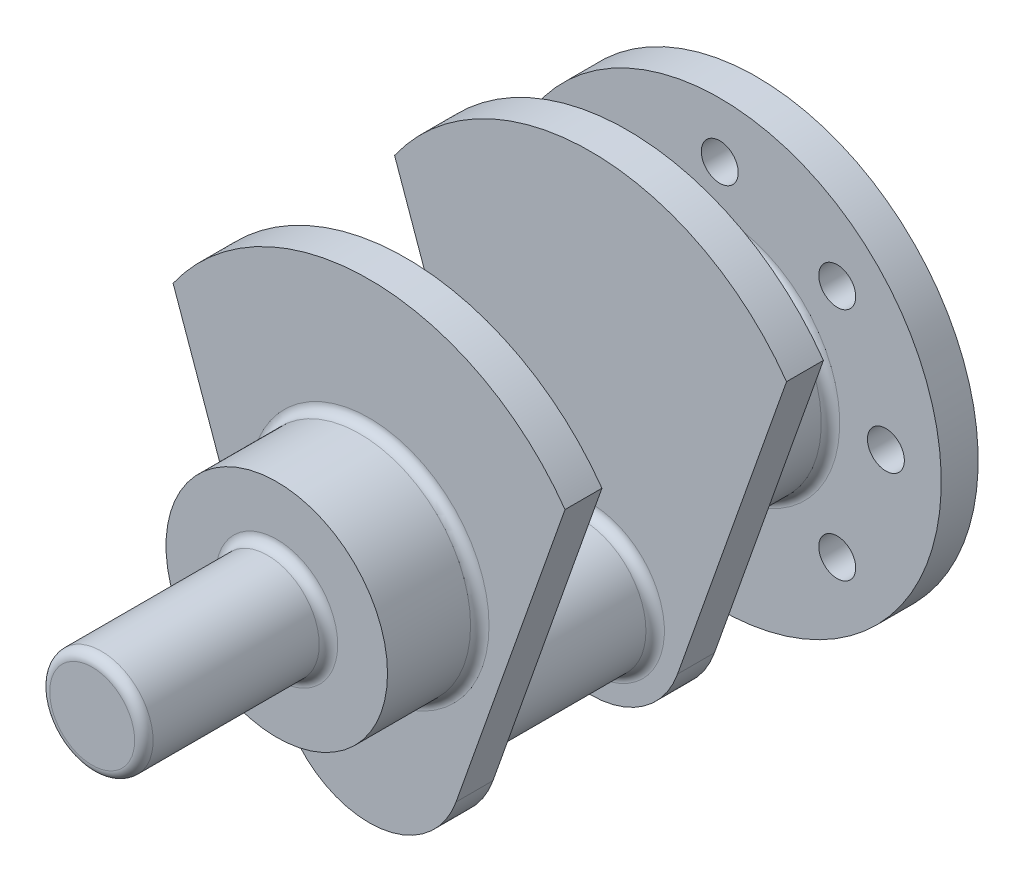
ISO-10303-21;
HEADER;
FILE_DESCRIPTION(('STEP AP214'),'2;1');
FILE_NAME('part.step','',(''),(''),'','','');
FILE_SCHEMA(('AUTOMOTIVE_DESIGN { 1 0 10303 214 1 1 1 1 }'));
ENDSEC;
DATA;
#1=APPLICATION_CONTEXT('core data for automotive mechanical design processes');
#2=APPLICATION_PROTOCOL_DEFINITION('international standard','automotive_design',2000,#1);
#3=PRODUCT_CONTEXT('',#1,'mechanical');
#4=PRODUCT('Part','Part','',(#3));
#5=PRODUCT_RELATED_PRODUCT_CATEGORY('part','',(#4));
#6=PRODUCT_DEFINITION_FORMATION('','',#4);
#7=PRODUCT_DEFINITION_CONTEXT('part definition',#1,'design');
#8=PRODUCT_DEFINITION('design','',#6,#7);
#9=PRODUCT_DEFINITION_SHAPE('','',#8);
#10=(LENGTH_UNIT() NAMED_UNIT(*) SI_UNIT(.MILLI.,.METRE.));
#11=(NAMED_UNIT(*) PLANE_ANGLE_UNIT() SI_UNIT($,.RADIAN.));
#12=(NAMED_UNIT(*) SI_UNIT($,.STERADIAN.) SOLID_ANGLE_UNIT());
#13=UNCERTAINTY_MEASURE_WITH_UNIT(LENGTH_MEASURE(1.E-05),#10,'distance_accuracy_value','');
#14=(GEOMETRIC_REPRESENTATION_CONTEXT(3) GLOBAL_UNCERTAINTY_ASSIGNED_CONTEXT((#13)) GLOBAL_UNIT_ASSIGNED_CONTEXT((#10,
#11,#12)) REPRESENTATION_CONTEXT('',''));
#15=CARTESIAN_POINT('',(0.,0.,0.));
#16=DIRECTION('',(0.,0.,1.));
#17=DIRECTION('',(1.,0.,0.));
#18=AXIS2_PLACEMENT_3D('',#15,#16,#17);
#19=CARTESIAN_POINT('',(0.,0.,20.));
#20=DIRECTION('',(0.,0.,-1.));
#21=DIRECTION('',(-1.,0.,0.));
#22=AXIS2_PLACEMENT_3D('',#19,#20,#21);
#23=CYLINDRICAL_SURFACE('',#22,130.);
#24=CARTESIAN_POINT('',(0.,0.,0.));
#25=DIRECTION('',(0.,0.,1.));
#26=DIRECTION('',(1.,0.,0.));
#27=AXIS2_PLACEMENT_3D('',#24,#25,#26);
#28=CIRCLE('',#27,130.);
#29=CARTESIAN_POINT('',(-106.16809456975,75.0222346736533,0.));
#30=VERTEX_POINT('',#29);
#31=CARTESIAN_POINT('',(106.16809456975,75.0222346736533,0.));
#32=VERTEX_POINT('',#31);
#33=EDGE_CURVE('E139',#30,#32,#28,.F.);
#34=ORIENTED_EDGE('',*,*,#33,.F.);
#35=DIRECTION('',(0.,0.,-1.));
#36=VECTOR('',#35,1.);
#37=CARTESIAN_POINT('',(-106.16809456975,75.0222346736533,20.));
#38=LINE('',#37,#36);
#39=CARTESIAN_POINT('',(-106.16809456975,75.0222346736533,20.));
#40=VERTEX_POINT('',#39);
#41=EDGE_CURVE('E82',#40,#30,#38,.T.);
#42=ORIENTED_EDGE('',*,*,#41,.F.);
#43=CARTESIAN_POINT('',(0.,0.,20.));
#44=DIRECTION('',(0.,0.,1.));
#45=DIRECTION('',(1.,0.,0.));
#46=AXIS2_PLACEMENT_3D('',#43,#44,#45);
#47=CIRCLE('',#46,130.);
#48=CARTESIAN_POINT('',(106.16809456975,75.0222346736533,20.));
#49=VERTEX_POINT('',#48);
#50=EDGE_CURVE('E145',#40,#49,#47,.F.);
#51=ORIENTED_EDGE('',*,*,#50,.T.);
#52=DIRECTION('',(0.,0.,-1.));
#53=VECTOR('',#52,1.);
#54=CARTESIAN_POINT('',(106.16809456975,75.0222346736533,20.));
#55=LINE('',#54,#53);
#56=EDGE_CURVE('E58',#49,#32,#55,.T.);
#57=ORIENTED_EDGE('',*,*,#56,.T.);
#58=EDGE_LOOP('',(#34,#42,#51,#57));
#59=FACE_BOUND('',#58,.T.);
#60=ADVANCED_FACE('F41',(#59),#23,.T.);
#61=CARTESIAN_POINT('',(-70.7315892189778,-25.0473694070523,20.));
#62=DIRECTION('',(0.942641491092178,0.333806859233772,0.));
#63=DIRECTION('',(-0.333806859233772,0.942641491092178,0.));
#64=AXIS2_PLACEMENT_3D('',#61,#62,#63);
#65=PLANE('',#64);
#66=DIRECTION('',(0.333806859233772,-0.942641491092178,0.));
#67=VECTOR('',#66,1.);
#68=CARTESIAN_POINT('',(-70.7315892189778,-25.0473694070523,0.));
#69=LINE('',#68,#67);
#70=CARTESIAN_POINT('',(-47.1320745546089,-91.6903429616886,0.));
#71=VERTEX_POINT('',#70);
#72=EDGE_CURVE('E155',#30,#71,#69,.T.);
#73=ORIENTED_EDGE('',*,*,#72,.T.);
#74=DIRECTION('',(0.,0.,-1.));
#75=VECTOR('',#74,1.);
#76=CARTESIAN_POINT('',(-47.1320745546089,-91.6903429616886,20.));
#77=LINE('',#76,#75);
#78=CARTESIAN_POINT('',(-47.1320745546089,-91.6903429616886,20.));
#79=VERTEX_POINT('',#78);
#80=EDGE_CURVE('E163',#79,#71,#77,.T.);
#81=ORIENTED_EDGE('',*,*,#80,.F.);
#82=DIRECTION('',(0.333806859233772,-0.942641491092178,0.));
#83=VECTOR('',#82,1.);
#84=CARTESIAN_POINT('',(-70.7315892189778,-25.0473694070523,20.));
#85=LINE('',#84,#83);
#86=EDGE_CURVE('E147',#40,#79,#85,.T.);
#87=ORIENTED_EDGE('',*,*,#86,.F.);
#88=ORIENTED_EDGE('',*,*,#41,.T.);
#89=EDGE_LOOP('',(#73,#81,#87,#88));
#90=FACE_BOUND('',#89,.T.);
#91=ADVANCED_FACE('F238',(#90),#65,.F.);
#92=CARTESIAN_POINT('',(0.,-75.,20.));
#93=DIRECTION('',(0.,0.,-1.));
#94=DIRECTION('',(-1.,0.,0.));
#95=AXIS2_PLACEMENT_3D('',#92,#93,#94);
#96=CYLINDRICAL_SURFACE('',#95,50.);
#97=CARTESIAN_POINT('',(0.,-75.,0.));
#98=DIRECTION('',(0.,0.,1.));
#99=DIRECTION('',(1.,0.,0.));
#100=AXIS2_PLACEMENT_3D('',#97,#98,#99);
#101=CIRCLE('',#100,50.);
#102=CARTESIAN_POINT('',(47.1320745546089,-91.6903429616886,0.));
#103=VERTEX_POINT('',#102);
#104=EDGE_CURVE('E157',#71,#103,#101,.T.);
#105=ORIENTED_EDGE('',*,*,#104,.T.);
#106=DIRECTION('',(0.,0.,-1.));
#107=VECTOR('',#106,1.);
#108=CARTESIAN_POINT('',(47.1320745546089,-91.6903429616886,20.));
#109=LINE('',#108,#107);
#110=CARTESIAN_POINT('',(47.1320745546089,-91.6903429616886,20.));
#111=VERTEX_POINT('',#110);
#112=EDGE_CURVE('E74',#111,#103,#109,.T.);
#113=ORIENTED_EDGE('',*,*,#112,.F.);
#114=CARTESIAN_POINT('',(0.,-75.,20.));
#115=DIRECTION('',(0.,0.,1.));
#116=DIRECTION('',(1.,0.,0.));
#117=AXIS2_PLACEMENT_3D('',#114,#115,#116);
#118=CIRCLE('',#117,50.);
#119=EDGE_CURVE('E150',#79,#111,#118,.T.);
#120=ORIENTED_EDGE('',*,*,#119,.F.);
#121=ORIENTED_EDGE('',*,*,#80,.T.);
#122=EDGE_LOOP('',(#105,#113,#120,#121));
#123=FACE_BOUND('',#122,.T.);
#124=ADVANCED_FACE('F243',(#123),#96,.T.);
#125=CARTESIAN_POINT('',(70.7315892189779,-25.0473694070522,20.));
#126=DIRECTION('',(0.942641491092178,-0.333806859233772,0.));
#127=DIRECTION('',(0.333806859233772,0.942641491092178,0.));
#128=AXIS2_PLACEMENT_3D('',#125,#126,#127);
#129=PLANE('',#128);
#130=DIRECTION('',(-0.333806859233772,-0.942641491092178,0.));
#131=VECTOR('',#130,1.);
#132=CARTESIAN_POINT('',(70.7315892189779,-25.0473694070522,0.));
#133=LINE('',#132,#131);
#134=EDGE_CURVE('E148',#32,#103,#133,.T.);
#135=ORIENTED_EDGE('',*,*,#134,.F.);
#136=ORIENTED_EDGE('',*,*,#56,.F.);
#137=DIRECTION('',(-0.333806859233772,-0.942641491092178,0.));
#138=VECTOR('',#137,1.);
#139=CARTESIAN_POINT('',(70.7315892189779,-25.0473694070522,20.));
#140=LINE('',#139,#138);
#141=EDGE_CURVE('E152',#49,#111,#140,.T.);
#142=ORIENTED_EDGE('',*,*,#141,.T.);
#143=ORIENTED_EDGE('',*,*,#112,.T.);
#144=EDGE_LOOP('',(#135,#136,#142,#143));
#145=FACE_BOUND('',#144,.T.);
#146=ADVANCED_FACE('F295',(#145),#129,.T.);
#147=CARTESIAN_POINT('',(0.,0.,20.));
#148=DIRECTION('',(0.,0.,1.));
#149=DIRECTION('',(1.,0.,0.));
#150=AXIS2_PLACEMENT_3D('',#147,#148,#149);
#151=PLANE('',#150);
#152=CARTESIAN_POINT('',(0.,0.,20.));
#153=DIRECTION('',(0.,0.,1.));
#154=DIRECTION('',(1.,0.,0.));
#155=AXIS2_PLACEMENT_3D('',#152,#153,#154);
#156=CIRCLE('',#155,65.);
#157=CARTESIAN_POINT('',(65.,0.,20.));
#158=VERTEX_POINT('',#157);
#159=EDGE_CURVE('E194',#158,#158,#156,.F.);
#160=ORIENTED_EDGE('',*,*,#159,.T.);
#161=EDGE_LOOP('',(#160));
#162=FACE_BOUND('',#161,.T.);
#163=ORIENTED_EDGE('',*,*,#50,.F.);
#164=ORIENTED_EDGE('',*,*,#86,.T.);
#165=ORIENTED_EDGE('',*,*,#119,.T.);
#166=ORIENTED_EDGE('',*,*,#141,.F.);
#167=EDGE_LOOP('',(#163,#164,#165,#166));
#168=FACE_BOUND('',#167,.T.);
#169=ADVANCED_FACE('F292',(#162,#168),#151,.T.);
#170=CARTESIAN_POINT('',(0.,0.,0.));
#171=DIRECTION('',(0.,0.,1.));
#172=DIRECTION('',(1.,0.,0.));
#173=AXIS2_PLACEMENT_3D('',#170,#171,#172);
#174=PLANE('',#173);
#175=CARTESIAN_POINT('',(0.,-75.,0.));
#176=DIRECTION('',(0.,0.,1.));
#177=DIRECTION('',(1.,0.,0.));
#178=AXIS2_PLACEMENT_3D('',#175,#176,#177);
#179=CIRCLE('',#178,40.);
#180=CARTESIAN_POINT('',(40.0000000000001,-75.,0.));
#181=VERTEX_POINT('',#180);
#182=EDGE_CURVE('E188',#181,#181,#179,.T.);
#183=ORIENTED_EDGE('',*,*,#182,.T.);
#184=EDGE_LOOP('',(#183));
#185=FACE_BOUND('',#184,.T.);
#186=ORIENTED_EDGE('',*,*,#33,.T.);
#187=ORIENTED_EDGE('',*,*,#134,.T.);
#188=ORIENTED_EDGE('',*,*,#104,.F.);
#189=ORIENTED_EDGE('',*,*,#72,.F.);
#190=EDGE_LOOP('',(#186,#187,#188,#189));
#191=FACE_BOUND('',#190,.T.);
#192=ADVANCED_FACE('F290',(#185,#191),#174,.F.);
#193=CARTESIAN_POINT('',(0.,-75.,-100.));
#194=DIRECTION('',(0.,0.,1.));
#195=DIRECTION('',(1.,0.,0.));
#196=AXIS2_PLACEMENT_3D('',#193,#194,#195);
#197=CYLINDRICAL_SURFACE('',#196,35.);
#198=CARTESIAN_POINT('',(0.,-75.,-95.));
#199=DIRECTION('',(0.,0.,-1.));
#200=DIRECTION('',(-1.,0.,0.));
#201=AXIS2_PLACEMENT_3D('',#198,#199,#200);
#202=CIRCLE('',#201,35.);
#203=CARTESIAN_POINT('',(-35.,-75.,-95.));
#204=VERTEX_POINT('',#203);
#205=EDGE_CURVE('E185',#204,#204,#202,.F.);
#206=ORIENTED_EDGE('',*,*,#205,.T.);
#207=EDGE_LOOP('',(#206));
#208=FACE_BOUND('',#207,.T.);
#209=CARTESIAN_POINT('',(0.,-75.,-5.));
#210=DIRECTION('',(0.,0.,1.));
#211=DIRECTION('',(1.,0.,0.));
#212=AXIS2_PLACEMENT_3D('',#209,#210,#211);
#213=CIRCLE('',#212,35.);
#214=CARTESIAN_POINT('',(35.0000000000001,-75.,-5.));
#215=VERTEX_POINT('',#214);
#216=EDGE_CURVE('E182',#215,#215,#213,.F.);
#217=ORIENTED_EDGE('',*,*,#216,.T.);
#218=EDGE_LOOP('',(#217));
#219=FACE_BOUND('',#218,.T.);
#220=ADVANCED_FACE('F276',(#208,#219),#197,.T.);
#221=CARTESIAN_POINT('',(0.,0.,70.));
#222=DIRECTION('',(0.,0.,-1.));
#223=DIRECTION('',(-1.,0.,0.));
#224=AXIS2_PLACEMENT_3D('',#221,#222,#223);
#225=CYLINDRICAL_SURFACE('',#224,60.);
#226=CARTESIAN_POINT('',(0.,0.,25.));
#227=DIRECTION('',(0.,0.,1.));
#228=DIRECTION('',(1.,0.,0.));
#229=AXIS2_PLACEMENT_3D('',#226,#227,#228);
#230=CIRCLE('',#229,60.);
#231=CARTESIAN_POINT('',(60.,0.,25.));
#232=VERTEX_POINT('',#231);
#233=EDGE_CURVE('E191',#232,#232,#230,.T.);
#234=ORIENTED_EDGE('',*,*,#233,.T.);
#235=EDGE_LOOP('',(#234));
#236=FACE_BOUND('',#235,.T.);
#237=CARTESIAN_POINT('',(0.,0.,70.));
#238=DIRECTION('',(0.,0.,1.));
#239=DIRECTION('',(1.,0.,0.));
#240=AXIS2_PLACEMENT_3D('',#237,#238,#239);
#241=CIRCLE('',#240,60.);
#242=CARTESIAN_POINT('',(60.,0.,70.));
#243=VERTEX_POINT('',#242);
#244=EDGE_CURVE('E136',#243,#243,#241,.T.);
#245=ORIENTED_EDGE('',*,*,#244,.F.);
#246=EDGE_LOOP('',(#245));
#247=FACE_BOUND('',#246,.T.);
#248=ADVANCED_FACE('F273',(#236,#247),#225,.T.);
#249=CARTESIAN_POINT('',(0.,0.,70.));
#250=DIRECTION('',(0.,0.,1.));
#251=DIRECTION('',(1.,0.,0.));
#252=AXIS2_PLACEMENT_3D('',#249,#250,#251);
#253=PLANE('',#252);
#254=CARTESIAN_POINT('',(0.,0.,70.));
#255=DIRECTION('',(0.,0.,1.));
#256=DIRECTION('',(1.,0.,0.));
#257=AXIS2_PLACEMENT_3D('',#254,#255,#256);
#258=CIRCLE('',#257,33.);
#259=CARTESIAN_POINT('',(33.,0.,70.));
#260=VERTEX_POINT('',#259);
#261=EDGE_CURVE('E50',#260,#260,#258,.F.);
#262=ORIENTED_EDGE('',*,*,#261,.T.);
#263=EDGE_LOOP('',(#262));
#264=FACE_BOUND('',#263,.T.);
#265=ORIENTED_EDGE('',*,*,#244,.T.);
#266=EDGE_LOOP('',(#265));
#267=FACE_BOUND('',#266,.T.);
#268=ADVANCED_FACE('F205',(#264,#267),#253,.T.);
#269=CARTESIAN_POINT('',(0.,0.,-120.));
#270=DIRECTION('',(0.,0.,1.));
#271=DIRECTION('',(1.,0.,0.));
#272=AXIS2_PLACEMENT_3D('',#269,#270,#271);
#273=CYLINDRICAL_SURFACE('',#272,130.);
#274=CARTESIAN_POINT('',(0.,0.,-100.));
#275=DIRECTION('',(0.,0.,1.));
#276=DIRECTION('',(1.,0.,0.));
#277=AXIS2_PLACEMENT_3D('',#274,#275,#276);
#278=CIRCLE('',#277,130.);
#279=CARTESIAN_POINT('',(-106.16809456975,75.0222346736533,-100.));
#280=VERTEX_POINT('',#279);
#281=CARTESIAN_POINT('',(106.16809456975,75.0222346736533,-100.));
#282=VERTEX_POINT('',#281);
#283=EDGE_CURVE('E135',#280,#282,#278,.F.);
#284=ORIENTED_EDGE('',*,*,#283,.T.);
#285=DIRECTION('',(0.,0.,1.));
#286=VECTOR('',#285,1.);
#287=CARTESIAN_POINT('',(106.16809456975,75.0222346736533,-120.));
#288=LINE('',#287,#286);
#289=CARTESIAN_POINT('',(106.16809456975,75.0222346736533,-120.));
#290=VERTEX_POINT('',#289);
#291=EDGE_CURVE('E116',#290,#282,#288,.T.);
#292=ORIENTED_EDGE('',*,*,#291,.F.);
#293=CARTESIAN_POINT('',(0.,0.,-120.));
#294=DIRECTION('',(0.,0.,1.));
#295=DIRECTION('',(1.,0.,0.));
#296=AXIS2_PLACEMENT_3D('',#293,#294,#295);
#297=CIRCLE('',#296,130.);
#298=CARTESIAN_POINT('',(-106.16809456975,75.0222346736533,-120.));
#299=VERTEX_POINT('',#298);
#300=EDGE_CURVE('E123',#299,#290,#297,.F.);
#301=ORIENTED_EDGE('',*,*,#300,.F.);
#302=DIRECTION('',(0.,0.,1.));
#303=VECTOR('',#302,1.);
#304=CARTESIAN_POINT('',(-106.16809456975,75.0222346736533,-120.));
#305=LINE('',#304,#303);
#306=EDGE_CURVE('E635',#299,#280,#305,.T.);
#307=ORIENTED_EDGE('',*,*,#306,.T.);
#308=EDGE_LOOP('',(#284,#292,#301,#307));
#309=FACE_BOUND('',#308,.T.);
#310=ADVANCED_FACE('F133',(#309),#273,.T.);
#311=CARTESIAN_POINT('',(70.7315892189779,-25.0473694070522,-120.));
#312=DIRECTION('',(-0.942641491092178,0.333806859233772,0.));
#313=DIRECTION('',(-0.333806859233772,-0.942641491092178,0.));
#314=AXIS2_PLACEMENT_3D('',#311,#312,#313);
#315=PLANE('',#314);
#316=DIRECTION('',(-0.333806859233772,-0.942641491092178,0.));
#317=VECTOR('',#316,1.);
#318=CARTESIAN_POINT('',(70.7315892189779,-25.0473694070522,-100.));
#319=LINE('',#318,#317);
#320=CARTESIAN_POINT('',(47.1320745546089,-91.6903429616886,-100.));
#321=VERTEX_POINT('',#320);
#322=EDGE_CURVE('E637',#282,#321,#319,.T.);
#323=ORIENTED_EDGE('',*,*,#322,.T.);
#324=DIRECTION('',(0.,0.,1.));
#325=VECTOR('',#324,1.);
#326=CARTESIAN_POINT('',(47.1320745546089,-91.6903429616886,-120.));
#327=LINE('',#326,#325);
#328=CARTESIAN_POINT('',(47.1320745546089,-91.6903429616886,-120.));
#329=VERTEX_POINT('',#328);
#330=EDGE_CURVE('E118',#329,#321,#327,.T.);
#331=ORIENTED_EDGE('',*,*,#330,.F.);
#332=DIRECTION('',(-0.333806859233772,-0.942641491092178,0.));
#333=VECTOR('',#332,1.);
#334=CARTESIAN_POINT('',(70.7315892189779,-25.0473694070522,-120.));
#335=LINE('',#334,#333);
#336=EDGE_CURVE('E111',#290,#329,#335,.T.);
#337=ORIENTED_EDGE('',*,*,#336,.F.);
#338=ORIENTED_EDGE('',*,*,#291,.T.);
#339=EDGE_LOOP('',(#323,#331,#337,#338));
#340=FACE_BOUND('',#339,.T.);
#341=ADVANCED_FACE('F114',(#340),#315,.F.);
#342=CARTESIAN_POINT('',(0.,-75.,-120.));
#343=DIRECTION('',(0.,0.,1.));
#344=DIRECTION('',(1.,0.,0.));
#345=AXIS2_PLACEMENT_3D('',#342,#343,#344);
#346=CYLINDRICAL_SURFACE('',#345,50.);
#347=CARTESIAN_POINT('',(0.,-75.,-100.));
#348=DIRECTION('',(0.,0.,1.));
#349=DIRECTION('',(1.,0.,0.));
#350=AXIS2_PLACEMENT_3D('',#347,#348,#349);
#351=CIRCLE('',#350,50.);
#352=CARTESIAN_POINT('',(-47.1320745546089,-91.6903429616886,-100.));
#353=VERTEX_POINT('',#352);
#354=EDGE_CURVE('E639',#353,#321,#351,.T.);
#355=ORIENTED_EDGE('',*,*,#354,.F.);
#356=DIRECTION('',(0.,0.,1.));
#357=VECTOR('',#356,1.);
#358=CARTESIAN_POINT('',(-47.1320745546089,-91.6903429616886,-120.));
#359=LINE('',#358,#357);
#360=CARTESIAN_POINT('',(-47.1320745546089,-91.6903429616886,-120.));
#361=VERTEX_POINT('',#360);
#362=EDGE_CURVE('E141',#361,#353,#359,.T.);
#363=ORIENTED_EDGE('',*,*,#362,.F.);
#364=CARTESIAN_POINT('',(0.,-75.,-120.));
#365=DIRECTION('',(0.,0.,1.));
#366=DIRECTION('',(1.,0.,0.));
#367=AXIS2_PLACEMENT_3D('',#364,#365,#366);
#368=CIRCLE('',#367,50.);
#369=EDGE_CURVE('E122',#361,#329,#368,.T.);
#370=ORIENTED_EDGE('',*,*,#369,.T.);
#371=ORIENTED_EDGE('',*,*,#330,.T.);
#372=EDGE_LOOP('',(#355,#363,#370,#371));
#373=FACE_BOUND('',#372,.T.);
#374=ADVANCED_FACE('F333',(#373),#346,.T.);
#375=CARTESIAN_POINT('',(-70.7315892189778,-25.0473694070523,-120.));
#376=DIRECTION('',(-0.942641491092178,-0.333806859233772,0.));
#377=DIRECTION('',(0.333806859233772,-0.942641491092178,0.));
#378=AXIS2_PLACEMENT_3D('',#375,#376,#377);
#379=PLANE('',#378);
#380=DIRECTION('',(0.333806859233772,-0.942641491092178,0.));
#381=VECTOR('',#380,1.);
#382=CARTESIAN_POINT('',(-70.7315892189778,-25.0473694070523,-100.));
#383=LINE('',#382,#381);
#384=EDGE_CURVE('E131',#280,#353,#383,.T.);
#385=ORIENTED_EDGE('',*,*,#384,.F.);
#386=ORIENTED_EDGE('',*,*,#306,.F.);
#387=DIRECTION('',(0.333806859233772,-0.942641491092178,0.));
#388=VECTOR('',#387,1.);
#389=CARTESIAN_POINT('',(-70.7315892189778,-25.0473694070523,-120.));
#390=LINE('',#389,#388);
#391=EDGE_CURVE('E129',#299,#361,#390,.T.);
#392=ORIENTED_EDGE('',*,*,#391,.T.);
#393=ORIENTED_EDGE('',*,*,#362,.T.);
#394=EDGE_LOOP('',(#385,#386,#392,#393));
#395=FACE_BOUND('',#394,.T.);
#396=ADVANCED_FACE('F340',(#395),#379,.T.);
#397=CARTESIAN_POINT('',(0.,0.,-120.));
#398=DIRECTION('',(0.,0.,-1.));
#399=DIRECTION('',(1.,0.,0.));
#400=AXIS2_PLACEMENT_3D('',#397,#398,#399);
#401=PLANE('',#400);
#402=CARTESIAN_POINT('',(0.,0.,-120.));
#403=DIRECTION('',(0.,0.,-1.));
#404=DIRECTION('',(-1.,0.,0.));
#405=AXIS2_PLACEMENT_3D('',#402,#403,#404);
#406=CIRCLE('',#405,65.);
#407=CARTESIAN_POINT('',(-65.,0.,-120.));
#408=VERTEX_POINT('',#407);
#409=EDGE_CURVE('E176',#408,#408,#406,.F.);
#410=ORIENTED_EDGE('',*,*,#409,.T.);
#411=EDGE_LOOP('',(#410));
#412=FACE_BOUND('',#411,.T.);
#413=ORIENTED_EDGE('',*,*,#300,.T.);
#414=ORIENTED_EDGE('',*,*,#336,.T.);
#415=ORIENTED_EDGE('',*,*,#369,.F.);
#416=ORIENTED_EDGE('',*,*,#391,.F.);
#417=EDGE_LOOP('',(#413,#414,#415,#416));
#418=FACE_BOUND('',#417,.T.);
#419=ADVANCED_FACE('F127',(#412,#418),#401,.T.);
#420=CARTESIAN_POINT('',(0.,0.,-100.));
#421=DIRECTION('',(0.,0.,-1.));
#422=DIRECTION('',(1.,0.,0.));
#423=AXIS2_PLACEMENT_3D('',#420,#421,#422);
#424=PLANE('',#423);
#425=CARTESIAN_POINT('',(0.,-75.,-100.));
#426=DIRECTION('',(0.,0.,-1.));
#427=DIRECTION('',(-1.,0.,0.));
#428=AXIS2_PLACEMENT_3D('',#425,#426,#427);
#429=CIRCLE('',#428,40.);
#430=CARTESIAN_POINT('',(-40.,-75.,-100.));
#431=VERTEX_POINT('',#430);
#432=EDGE_CURVE('E179',#431,#431,#429,.T.);
#433=ORIENTED_EDGE('',*,*,#432,.T.);
#434=EDGE_LOOP('',(#433));
#435=FACE_BOUND('',#434,.T.);
#436=ORIENTED_EDGE('',*,*,#283,.F.);
#437=ORIENTED_EDGE('',*,*,#384,.T.);
#438=ORIENTED_EDGE('',*,*,#354,.T.);
#439=ORIENTED_EDGE('',*,*,#322,.F.);
#440=EDGE_LOOP('',(#436,#437,#438,#439));
#441=FACE_BOUND('',#440,.T.);
#442=ADVANCED_FACE('F471',(#435,#441),#424,.F.);
#443=CARTESIAN_POINT('',(0.,0.,-170.));
#444=DIRECTION('',(0.,0.,1.));
#445=DIRECTION('',(1.,0.,0.));
#446=AXIS2_PLACEMENT_3D('',#443,#444,#445);
#447=CYLINDRICAL_SURFACE('',#446,60.);
#448=CARTESIAN_POINT('',(0.,0.,-165.));
#449=DIRECTION('',(0.,0.,-1.));
#450=DIRECTION('',(-1.,0.,0.));
#451=AXIS2_PLACEMENT_3D('',#448,#449,#450);
#452=CIRCLE('',#451,60.);
#453=CARTESIAN_POINT('',(-60.,0.,-165.));
#454=VERTEX_POINT('',#453);
#455=EDGE_CURVE('E170',#454,#454,#452,.F.);
#456=ORIENTED_EDGE('',*,*,#455,.T.);
#457=EDGE_LOOP('',(#456));
#458=FACE_BOUND('',#457,.T.);
#459=CARTESIAN_POINT('',(0.,0.,-125.));
#460=DIRECTION('',(0.,0.,-1.));
#461=DIRECTION('',(-1.,0.,0.));
#462=AXIS2_PLACEMENT_3D('',#459,#460,#461);
#463=CIRCLE('',#462,60.);
#464=CARTESIAN_POINT('',(-60.,0.,-125.));
#465=VERTEX_POINT('',#464);
#466=EDGE_CURVE('E167',#465,#465,#463,.T.);
#467=ORIENTED_EDGE('',*,*,#466,.T.);
#468=EDGE_LOOP('',(#467));
#469=FACE_BOUND('',#468,.T.);
#470=ADVANCED_FACE('F218',(#458,#469),#447,.T.);
#471=CARTESIAN_POINT('',(0.,0.,170.));
#472=DIRECTION('',(0.,0.,-1.));
#473=DIRECTION('',(-1.,0.,0.));
#474=AXIS2_PLACEMENT_3D('',#471,#472,#473);
#475=CYLINDRICAL_SURFACE('',#474,28.);
#476=CARTESIAN_POINT('',(0.,0.,75.));
#477=DIRECTION('',(0.,0.,1.));
#478=DIRECTION('',(1.,0.,0.));
#479=AXIS2_PLACEMENT_3D('',#476,#477,#478);
#480=CIRCLE('',#479,28.);
#481=CARTESIAN_POINT('',(28.,0.,75.));
#482=VERTEX_POINT('',#481);
#483=EDGE_CURVE('E200',#482,#482,#480,.T.);
#484=ORIENTED_EDGE('',*,*,#483,.T.);
#485=EDGE_LOOP('',(#484));
#486=FACE_BOUND('',#485,.T.);
#487=CARTESIAN_POINT('',(0.,0.,165.));
#488=DIRECTION('',(0.,0.,1.));
#489=DIRECTION('',(1.,0.,0.));
#490=AXIS2_PLACEMENT_3D('',#487,#488,#489);
#491=CIRCLE('',#490,28.);
#492=CARTESIAN_POINT('',(28.,0.,165.));
#493=VERTEX_POINT('',#492);
#494=EDGE_CURVE('E197',#493,#493,#491,.F.);
#495=ORIENTED_EDGE('',*,*,#494,.T.);
#496=EDGE_LOOP('',(#495));
#497=FACE_BOUND('',#496,.T.);
#498=ADVANCED_FACE('F214',(#486,#497),#475,.T.);
#499=CARTESIAN_POINT('',(0.,0.,170.));
#500=DIRECTION('',(0.,0.,1.));
#501=DIRECTION('',(1.,0.,0.));
#502=AXIS2_PLACEMENT_3D('',#499,#500,#501);
#503=PLANE('',#502);
#504=CARTESIAN_POINT('',(0.,0.,170.));
#505=DIRECTION('',(0.,0.,1.));
#506=DIRECTION('',(1.,0.,0.));
#507=AXIS2_PLACEMENT_3D('',#504,#505,#506);
#508=CIRCLE('',#507,23.);
#509=CARTESIAN_POINT('',(23.,0.,170.));
#510=VERTEX_POINT('',#509);
#511=EDGE_CURVE('E11',#510,#510,#508,.T.);
#512=ORIENTED_EDGE('',*,*,#511,.T.);
#513=EDGE_LOOP('',(#512));
#514=FACE_BOUND('',#513,.T.);
#515=ADVANCED_FACE('F217',(#514),#503,.T.);
#516=CARTESIAN_POINT('',(0.,0.,-190.));
#517=DIRECTION('',(0.,0.,-1.));
#518=DIRECTION('',(-1.,0.,0.));
#519=AXIS2_PLACEMENT_3D('',#516,#517,#518);
#520=PLANE('',#519);
#521=CARTESIAN_POINT('',(90.,0.,-190.));
#522=DIRECTION('',(0.,0.,-1.));
#523=DIRECTION('',(-1.,0.,0.));
#524=AXIS2_PLACEMENT_3D('',#521,#522,#523);
#525=CIRCLE('',#524,10.0000000000009);
#526=CARTESIAN_POINT('',(79.9999999999991,0.,-190.));
#527=VERTEX_POINT('',#526);
#528=EDGE_CURVE('E601',#527,#527,#525,.T.);
#529=ORIENTED_EDGE('',*,*,#528,.F.);
#530=EDGE_LOOP('',(#529));
#531=FACE_BOUND('',#530,.T.);
#532=CARTESIAN_POINT('',(6.28466640991764E-13,-90.,-190.));
#533=DIRECTION('',(0.,0.,-1.));
#534=DIRECTION('',(-1.,0.,0.));
#535=AXIS2_PLACEMENT_3D('',#532,#533,#534);
#536=CIRCLE('',#535,10.);
#537=CARTESIAN_POINT('',(-9.99999999999937,-90.,-190.));
#538=VERTEX_POINT('',#537);
#539=EDGE_CURVE('E609',#538,#538,#536,.T.);
#540=ORIENTED_EDGE('',*,*,#539,.F.);
#541=EDGE_LOOP('',(#540));
#542=FACE_BOUND('',#541,.T.);
#543=CARTESIAN_POINT('',(-90.,-3.14233320495882E-13,-190.));
#544=DIRECTION('',(0.,0.,-1.));
#545=DIRECTION('',(-1.,0.,0.));
#546=AXIS2_PLACEMENT_3D('',#543,#544,#545);
#547=CIRCLE('',#546,10.);
#548=CARTESIAN_POINT('',(-100.,-3.14233320495882E-13,-190.));
#549=VERTEX_POINT('',#548);
#550=EDGE_CURVE('E617',#549,#549,#547,.T.);
#551=ORIENTED_EDGE('',*,*,#550,.F.);
#552=EDGE_LOOP('',(#551));
#553=FACE_BOUND('',#552,.T.);
#554=CARTESIAN_POINT('',(0.,90.,-190.));
#555=DIRECTION('',(0.,0.,-1.));
#556=DIRECTION('',(-1.,0.,0.));
#557=AXIS2_PLACEMENT_3D('',#554,#555,#556);
#558=CIRCLE('',#557,10.);
#559=CARTESIAN_POINT('',(-10.,90.,-190.));
#560=VERTEX_POINT('',#559);
#561=EDGE_CURVE('E625',#560,#560,#558,.T.);
#562=ORIENTED_EDGE('',*,*,#561,.F.);
#563=EDGE_LOOP('',(#562));
#564=FACE_BOUND('',#563,.T.);
#565=CARTESIAN_POINT('',(0.,0.,-190.));
#566=DIRECTION('',(0.,0.,-1.));
#567=DIRECTION('',(-1.,0.,0.));
#568=AXIS2_PLACEMENT_3D('',#565,#566,#567);
#569=CIRCLE('',#568,120.);
#570=CARTESIAN_POINT('',(-120.,0.,-190.));
#571=VERTEX_POINT('',#570);
#572=EDGE_CURVE('E629',#571,#571,#569,.T.);
#573=ORIENTED_EDGE('',*,*,#572,.T.);
#574=EDGE_LOOP('',(#573));
#575=FACE_BOUND('',#574,.T.);
#576=CARTESIAN_POINT('',(-63.6396103067894,63.6396103067892,-190.));
#577=DIRECTION('',(0.,0.,-1.));
#578=DIRECTION('',(-1.,0.,0.));
#579=AXIS2_PLACEMENT_3D('',#576,#577,#578);
#580=CIRCLE('',#579,10.);
#581=CARTESIAN_POINT('',(-73.6396103067894,63.6396103067892,-190.));
#582=VERTEX_POINT('',#581);
#583=EDGE_CURVE('E621',#582,#582,#580,.T.);
#584=ORIENTED_EDGE('',*,*,#583,.F.);
#585=EDGE_LOOP('',(#584));
#586=FACE_BOUND('',#585,.T.);
#587=CARTESIAN_POINT('',(-63.639610306789,-63.6396103067896,-190.));
#588=DIRECTION('',(0.,0.,-1.));
#589=DIRECTION('',(-1.,0.,0.));
#590=AXIS2_PLACEMENT_3D('',#587,#588,#589);
#591=CIRCLE('',#590,10.);
#592=CARTESIAN_POINT('',(-73.639610306789,-63.6396103067896,-190.));
#593=VERTEX_POINT('',#592);
#594=EDGE_CURVE('E613',#593,#593,#591,.T.);
#595=ORIENTED_EDGE('',*,*,#594,.F.);
#596=EDGE_LOOP('',(#595));
#597=FACE_BOUND('',#596,.T.);
#598=CARTESIAN_POINT('',(63.6396103067898,-63.6396103067887,-190.));
#599=DIRECTION('',(0.,0.,-1.));
#600=DIRECTION('',(-1.,0.,0.));
#601=AXIS2_PLACEMENT_3D('',#598,#599,#600);
#602=CIRCLE('',#601,10.);
#603=CARTESIAN_POINT('',(53.6396103067898,-63.6396103067887,-190.));
#604=VERTEX_POINT('',#603);
#605=EDGE_CURVE('E605',#604,#604,#602,.T.);
#606=ORIENTED_EDGE('',*,*,#605,.F.);
#607=EDGE_LOOP('',(#606));
#608=FACE_BOUND('',#607,.T.);
#609=CARTESIAN_POINT('',(63.6396103067885,63.6396103067901,-190.));
#610=DIRECTION('',(0.,0.,-1.));
#611=DIRECTION('',(-1.,0.,0.));
#612=AXIS2_PLACEMENT_3D('',#609,#610,#611);
#613=CIRCLE('',#612,9.99999999999999);
#614=CARTESIAN_POINT('',(53.6396103067885,63.6396103067901,-190.));
#615=VERTEX_POINT('',#614);
#616=EDGE_CURVE('E596',#615,#615,#613,.T.);
#617=ORIENTED_EDGE('',*,*,#616,.F.);
#618=EDGE_LOOP('',(#617));
#619=FACE_BOUND('',#618,.T.);
#620=ADVANCED_FACE('F227',(#531,#542,#553,#564,#575,#586,#597,#608,#619),#520,.T.);
#621=CARTESIAN_POINT('',(0.,0.,-170.));
#622=DIRECTION('',(0.,0.,-1.));
#623=DIRECTION('',(-1.,0.,0.));
#624=AXIS2_PLACEMENT_3D('',#621,#622,#623);
#625=PLANE('',#624);
#626=CARTESIAN_POINT('',(0.,0.,-170.));
#627=DIRECTION('',(0.,0.,-1.));
#628=DIRECTION('',(-1.,0.,0.));
#629=AXIS2_PLACEMENT_3D('',#626,#627,#628);
#630=CIRCLE('',#629,65.);
#631=CARTESIAN_POINT('',(-65.,0.,-170.));
#632=VERTEX_POINT('',#631);
#633=EDGE_CURVE('E173',#632,#632,#630,.T.);
#634=ORIENTED_EDGE('',*,*,#633,.T.);
#635=EDGE_LOOP('',(#634));
#636=FACE_BOUND('',#635,.T.);
#637=CARTESIAN_POINT('',(0.,0.,-170.));
#638=DIRECTION('',(0.,0.,-1.));
#639=DIRECTION('',(-1.,0.,0.));
#640=AXIS2_PLACEMENT_3D('',#637,#638,#639);
#641=CIRCLE('',#640,120.);
#642=CARTESIAN_POINT('',(-120.,0.,-170.));
#643=VERTEX_POINT('',#642);
#644=EDGE_CURVE('E563',#643,#643,#641,.T.);
#645=ORIENTED_EDGE('',*,*,#644,.F.);
#646=EDGE_LOOP('',(#645));
#647=FACE_BOUND('',#646,.T.);
#648=CARTESIAN_POINT('',(0.,90.,-170.));
#649=DIRECTION('',(0.,0.,-1.));
#650=DIRECTION('',(-1.,0.,0.));
#651=AXIS2_PLACEMENT_3D('',#648,#649,#650);
#652=CIRCLE('',#651,10.);
#653=CARTESIAN_POINT('',(-10.,90.,-170.));
#654=VERTEX_POINT('',#653);
#655=EDGE_CURVE('E567',#654,#654,#652,.T.);
#656=ORIENTED_EDGE('',*,*,#655,.T.);
#657=EDGE_LOOP('',(#656));
#658=FACE_BOUND('',#657,.T.);
#659=CARTESIAN_POINT('',(-63.6396103067894,63.6396103067892,-170.));
#660=DIRECTION('',(0.,0.,-1.));
#661=DIRECTION('',(-1.,0.,0.));
#662=AXIS2_PLACEMENT_3D('',#659,#660,#661);
#663=CIRCLE('',#662,10.);
#664=CARTESIAN_POINT('',(-73.6396103067894,63.6396103067892,-170.));
#665=VERTEX_POINT('',#664);
#666=EDGE_CURVE('E571',#665,#665,#663,.T.);
#667=ORIENTED_EDGE('',*,*,#666,.T.);
#668=EDGE_LOOP('',(#667));
#669=FACE_BOUND('',#668,.T.);
#670=CARTESIAN_POINT('',(-90.,-3.14233320495882E-13,-170.));
#671=DIRECTION('',(0.,0.,-1.));
#672=DIRECTION('',(-1.,0.,0.));
#673=AXIS2_PLACEMENT_3D('',#670,#671,#672);
#674=CIRCLE('',#673,10.);
#675=CARTESIAN_POINT('',(-100.,-3.14233320495882E-13,-170.));
#676=VERTEX_POINT('',#675);
#677=EDGE_CURVE('E575',#676,#676,#674,.T.);
#678=ORIENTED_EDGE('',*,*,#677,.T.);
#679=EDGE_LOOP('',(#678));
#680=FACE_BOUND('',#679,.T.);
#681=CARTESIAN_POINT('',(-63.639610306789,-63.6396103067896,-170.));
#682=DIRECTION('',(0.,0.,-1.));
#683=DIRECTION('',(-1.,0.,0.));
#684=AXIS2_PLACEMENT_3D('',#681,#682,#683);
#685=CIRCLE('',#684,10.);
#686=CARTESIAN_POINT('',(-73.639610306789,-63.6396103067896,-170.));
#687=VERTEX_POINT('',#686);
#688=EDGE_CURVE('E579',#687,#687,#685,.T.);
#689=ORIENTED_EDGE('',*,*,#688,.T.);
#690=EDGE_LOOP('',(#689));
#691=FACE_BOUND('',#690,.T.);
#692=CARTESIAN_POINT('',(6.28466640991764E-13,-90.,-170.));
#693=DIRECTION('',(0.,0.,-1.));
#694=DIRECTION('',(-1.,0.,0.));
#695=AXIS2_PLACEMENT_3D('',#692,#693,#694);
#696=CIRCLE('',#695,10.);
#697=CARTESIAN_POINT('',(-9.99999999999937,-90.,-170.));
#698=VERTEX_POINT('',#697);
#699=EDGE_CURVE('E583',#698,#698,#696,.T.);
#700=ORIENTED_EDGE('',*,*,#699,.T.);
#701=EDGE_LOOP('',(#700));
#702=FACE_BOUND('',#701,.T.);
#703=CARTESIAN_POINT('',(63.6396103067898,-63.6396103067887,-170.));
#704=DIRECTION('',(0.,0.,-1.));
#705=DIRECTION('',(-1.,0.,0.));
#706=AXIS2_PLACEMENT_3D('',#703,#704,#705);
#707=CIRCLE('',#706,10.);
#708=CARTESIAN_POINT('',(53.6396103067898,-63.6396103067887,-170.));
#709=VERTEX_POINT('',#708);
#710=EDGE_CURVE('E587',#709,#709,#707,.T.);
#711=ORIENTED_EDGE('',*,*,#710,.T.);
#712=EDGE_LOOP('',(#711));
#713=FACE_BOUND('',#712,.T.);
#714=CARTESIAN_POINT('',(90.,0.,-170.));
#715=DIRECTION('',(0.,0.,-1.));
#716=DIRECTION('',(-1.,0.,0.));
#717=AXIS2_PLACEMENT_3D('',#714,#715,#716);
#718=CIRCLE('',#717,10.0000000000009);
#719=CARTESIAN_POINT('',(79.9999999999991,0.,-170.));
#720=VERTEX_POINT('',#719);
#721=EDGE_CURVE('E591',#720,#720,#718,.T.);
#722=ORIENTED_EDGE('',*,*,#721,.T.);
#723=EDGE_LOOP('',(#722));
#724=FACE_BOUND('',#723,.T.);
#725=CARTESIAN_POINT('',(63.6396103067885,63.6396103067901,-170.));
#726=DIRECTION('',(0.,0.,-1.));
#727=DIRECTION('',(-1.,0.,0.));
#728=AXIS2_PLACEMENT_3D('',#725,#726,#727);
#729=CIRCLE('',#728,9.99999999999999);
#730=CARTESIAN_POINT('',(53.6396103067885,63.6396103067901,-170.));
#731=VERTEX_POINT('',#730);
#732=EDGE_CURVE('E594',#731,#731,#729,.T.);
#733=ORIENTED_EDGE('',*,*,#732,.T.);
#734=EDGE_LOOP('',(#733));
#735=FACE_BOUND('',#734,.T.);
#736=ADVANCED_FACE('F233',(#636,#647,#658,#669,#680,#691,#702,#713,#724,#735),#625,.F.);
#737=CARTESIAN_POINT('',(0.,0.,-190.));
#738=DIRECTION('',(0.,0.,1.));
#739=DIRECTION('',(1.,0.,0.));
#740=AXIS2_PLACEMENT_3D('',#737,#738,#739);
#741=CYLINDRICAL_SURFACE('',#740,120.);
#742=ORIENTED_EDGE('',*,*,#572,.F.);
#743=EDGE_LOOP('',(#742));
#744=FACE_BOUND('',#743,.T.);
#745=ORIENTED_EDGE('',*,*,#644,.T.);
#746=EDGE_LOOP('',(#745));
#747=FACE_BOUND('',#746,.T.);
#748=ADVANCED_FACE('F361',(#744,#747),#741,.T.);
#749=CARTESIAN_POINT('',(0.,90.,-190.));
#750=DIRECTION('',(0.,0.,1.));
#751=DIRECTION('',(1.,0.,0.));
#752=AXIS2_PLACEMENT_3D('',#749,#750,#751);
#753=CYLINDRICAL_SURFACE('',#752,10.);
#754=ORIENTED_EDGE('',*,*,#561,.T.);
#755=EDGE_LOOP('',(#754));
#756=FACE_BOUND('',#755,.T.);
#757=ORIENTED_EDGE('',*,*,#655,.F.);
#758=EDGE_LOOP('',(#757));
#759=FACE_BOUND('',#758,.T.);
#760=ADVANCED_FACE('F365',(#756,#759),#753,.F.);
#761=CARTESIAN_POINT('',(-63.6396103067894,63.6396103067892,-190.));
#762=DIRECTION('',(0.,0.,1.));
#763=DIRECTION('',(1.,0.,0.));
#764=AXIS2_PLACEMENT_3D('',#761,#762,#763);
#765=CYLINDRICAL_SURFACE('',#764,10.);
#766=ORIENTED_EDGE('',*,*,#583,.T.);
#767=EDGE_LOOP('',(#766));
#768=FACE_BOUND('',#767,.T.);
#769=ORIENTED_EDGE('',*,*,#666,.F.);
#770=EDGE_LOOP('',(#769));
#771=FACE_BOUND('',#770,.T.);
#772=ADVANCED_FACE('F373',(#768,#771),#765,.F.);
#773=CARTESIAN_POINT('',(-90.,-3.14233320495882E-13,-190.));
#774=DIRECTION('',(0.,0.,1.));
#775=DIRECTION('',(1.,0.,0.));
#776=AXIS2_PLACEMENT_3D('',#773,#774,#775);
#777=CYLINDRICAL_SURFACE('',#776,10.);
#778=ORIENTED_EDGE('',*,*,#550,.T.);
#779=EDGE_LOOP('',(#778));
#780=FACE_BOUND('',#779,.T.);
#781=ORIENTED_EDGE('',*,*,#677,.F.);
#782=EDGE_LOOP('',(#781));
#783=FACE_BOUND('',#782,.T.);
#784=ADVANCED_FACE('F382',(#780,#783),#777,.F.);
#785=CARTESIAN_POINT('',(-63.639610306789,-63.6396103067896,-190.));
#786=DIRECTION('',(0.,0.,1.));
#787=DIRECTION('',(1.,0.,0.));
#788=AXIS2_PLACEMENT_3D('',#785,#786,#787);
#789=CYLINDRICAL_SURFACE('',#788,10.);
#790=ORIENTED_EDGE('',*,*,#594,.T.);
#791=EDGE_LOOP('',(#790));
#792=FACE_BOUND('',#791,.T.);
#793=ORIENTED_EDGE('',*,*,#688,.F.);
#794=EDGE_LOOP('',(#793));
#795=FACE_BOUND('',#794,.T.);
#796=ADVANCED_FACE('F391',(#792,#795),#789,.F.);
#797=CARTESIAN_POINT('',(6.28466640991764E-13,-90.,-190.));
#798=DIRECTION('',(0.,0.,1.));
#799=DIRECTION('',(1.,0.,0.));
#800=AXIS2_PLACEMENT_3D('',#797,#798,#799);
#801=CYLINDRICAL_SURFACE('',#800,10.);
#802=ORIENTED_EDGE('',*,*,#539,.T.);
#803=EDGE_LOOP('',(#802));
#804=FACE_BOUND('',#803,.T.);
#805=ORIENTED_EDGE('',*,*,#699,.F.);
#806=EDGE_LOOP('',(#805));
#807=FACE_BOUND('',#806,.T.);
#808=ADVANCED_FACE('F400',(#804,#807),#801,.F.);
#809=CARTESIAN_POINT('',(63.6396103067898,-63.6396103067887,-190.));
#810=DIRECTION('',(0.,0.,1.));
#811=DIRECTION('',(1.,0.,0.));
#812=AXIS2_PLACEMENT_3D('',#809,#810,#811);
#813=CYLINDRICAL_SURFACE('',#812,10.);
#814=ORIENTED_EDGE('',*,*,#605,.T.);
#815=EDGE_LOOP('',(#814));
#816=FACE_BOUND('',#815,.T.);
#817=ORIENTED_EDGE('',*,*,#710,.F.);
#818=EDGE_LOOP('',(#817));
#819=FACE_BOUND('',#818,.T.);
#820=ADVANCED_FACE('F409',(#816,#819),#813,.F.);
#821=CARTESIAN_POINT('',(90.,0.,-190.));
#822=DIRECTION('',(0.,0.,1.));
#823=DIRECTION('',(1.,0.,0.));
#824=AXIS2_PLACEMENT_3D('',#821,#822,#823);
#825=CYLINDRICAL_SURFACE('',#824,10.0000000000009);
#826=ORIENTED_EDGE('',*,*,#528,.T.);
#827=EDGE_LOOP('',(#826));
#828=FACE_BOUND('',#827,.T.);
#829=ORIENTED_EDGE('',*,*,#721,.F.);
#830=EDGE_LOOP('',(#829));
#831=FACE_BOUND('',#830,.T.);
#832=ADVANCED_FACE('F418',(#828,#831),#825,.F.);
#833=CARTESIAN_POINT('',(63.6396103067885,63.6396103067901,-190.));
#834=DIRECTION('',(0.,0.,1.));
#835=DIRECTION('',(1.,0.,0.));
#836=AXIS2_PLACEMENT_3D('',#833,#834,#835);
#837=CYLINDRICAL_SURFACE('',#836,9.99999999999999);
#838=ORIENTED_EDGE('',*,*,#616,.T.);
#839=EDGE_LOOP('',(#838));
#840=FACE_BOUND('',#839,.T.);
#841=ORIENTED_EDGE('',*,*,#732,.F.);
#842=EDGE_LOOP('',(#841));
#843=FACE_BOUND('',#842,.T.);
#844=ADVANCED_FACE('F252',(#840,#843),#837,.F.);
#845=CARTESIAN_POINT('',(0.,0.,-165.));
#846=DIRECTION('',(0.,0.,-1.));
#847=DIRECTION('',(-1.,0.,0.));
#848=AXIS2_PLACEMENT_3D('',#845,#846,#847);
#849=TOROIDAL_SURFACE('',#848,65.,5.);
#850=ORIENTED_EDGE('',*,*,#633,.F.);
#851=EDGE_LOOP('',(#850));
#852=FACE_BOUND('',#851,.T.);
#853=ORIENTED_EDGE('',*,*,#455,.F.);
#854=EDGE_LOOP('',(#853));
#855=FACE_BOUND('',#854,.T.);
#856=ADVANCED_FACE('F248',(#852,#855),#849,.F.);
#857=CARTESIAN_POINT('',(0.,0.,-125.));
#858=DIRECTION('',(0.,0.,-1.));
#859=DIRECTION('',(-1.,0.,0.));
#860=AXIS2_PLACEMENT_3D('',#857,#858,#859);
#861=TOROIDAL_SURFACE('',#860,65.,5.);
#862=ORIENTED_EDGE('',*,*,#466,.F.);
#863=EDGE_LOOP('',(#862));
#864=FACE_BOUND('',#863,.T.);
#865=ORIENTED_EDGE('',*,*,#409,.F.);
#866=EDGE_LOOP('',(#865));
#867=FACE_BOUND('',#866,.T.);
#868=ADVANCED_FACE('F251',(#864,#867),#861,.F.);
#869=CARTESIAN_POINT('',(0.,-75.,-95.));
#870=DIRECTION('',(0.,0.,-1.));
#871=DIRECTION('',(-1.,0.,0.));
#872=AXIS2_PLACEMENT_3D('',#869,#870,#871);
#873=TOROIDAL_SURFACE('',#872,40.,5.);
#874=ORIENTED_EDGE('',*,*,#205,.F.);
#875=EDGE_LOOP('',(#874));
#876=FACE_BOUND('',#875,.T.);
#877=ORIENTED_EDGE('',*,*,#432,.F.);
#878=EDGE_LOOP('',(#877));
#879=FACE_BOUND('',#878,.T.);
#880=ADVANCED_FACE('F256',(#876,#879),#873,.F.);
#881=CARTESIAN_POINT('',(0.,-75.,-5.));
#882=DIRECTION('',(0.,0.,1.));
#883=DIRECTION('',(1.,0.,0.));
#884=AXIS2_PLACEMENT_3D('',#881,#882,#883);
#885=TOROIDAL_SURFACE('',#884,40.,5.);
#886=ORIENTED_EDGE('',*,*,#182,.F.);
#887=EDGE_LOOP('',(#886));
#888=FACE_BOUND('',#887,.T.);
#889=ORIENTED_EDGE('',*,*,#216,.F.);
#890=EDGE_LOOP('',(#889));
#891=FACE_BOUND('',#890,.T.);
#892=ADVANCED_FACE('F260',(#888,#891),#885,.F.);
#893=CARTESIAN_POINT('',(0.,0.,25.));
#894=DIRECTION('',(0.,0.,1.));
#895=DIRECTION('',(1.,0.,0.));
#896=AXIS2_PLACEMENT_3D('',#893,#894,#895);
#897=TOROIDAL_SURFACE('',#896,65.,5.);
#898=ORIENTED_EDGE('',*,*,#159,.F.);
#899=EDGE_LOOP('',(#898));
#900=FACE_BOUND('',#899,.T.);
#901=ORIENTED_EDGE('',*,*,#233,.F.);
#902=EDGE_LOOP('',(#901));
#903=FACE_BOUND('',#902,.T.);
#904=ADVANCED_FACE('F211',(#900,#903),#897,.F.);
#905=CARTESIAN_POINT('',(0.,0.,75.));
#906=DIRECTION('',(0.,0.,1.));
#907=DIRECTION('',(1.,0.,0.));
#908=AXIS2_PLACEMENT_3D('',#905,#906,#907);
#909=TOROIDAL_SURFACE('',#908,33.,5.);
#910=ORIENTED_EDGE('',*,*,#261,.F.);
#911=EDGE_LOOP('',(#910));
#912=FACE_BOUND('',#911,.T.);
#913=ORIENTED_EDGE('',*,*,#483,.F.);
#914=EDGE_LOOP('',(#913));
#915=FACE_BOUND('',#914,.T.);
#916=ADVANCED_FACE('F208',(#912,#915),#909,.F.);
#917=CARTESIAN_POINT('',(0.,0.,165.));
#918=DIRECTION('',(0.,0.,1.));
#919=DIRECTION('',(1.,0.,0.));
#920=AXIS2_PLACEMENT_3D('',#917,#918,#919);
#921=TOROIDAL_SURFACE('',#920,23.,5.);
#922=ORIENTED_EDGE('',*,*,#494,.F.);
#923=EDGE_LOOP('',(#922));
#924=FACE_BOUND('',#923,.T.);
#925=ORIENTED_EDGE('',*,*,#511,.F.);
#926=EDGE_LOOP('',(#925));
#927=FACE_BOUND('',#926,.T.);
#928=ADVANCED_FACE('F43',(#924,#927),#921,.T.);
#929=CLOSED_SHELL('',(#60,#91,#124,#146,#169,#192,#220,#248,#268,#310,#341,#374,#396,#419,#442,
#470,#498,#515,#620,#736,#748,#760,#772,#784,#796,#808,#820,#832,#844,#856,#868,#880,#892,#904,
#916,#928));
#930=MANIFOLD_SOLID_BREP('B2',#929);
#931=ADVANCED_BREP_SHAPE_REPRESENTATION('',(#18,#930),#14);
#932=SHAPE_DEFINITION_REPRESENTATION(#9,#931);
ENDSEC;
END-ISO-10303-21;
